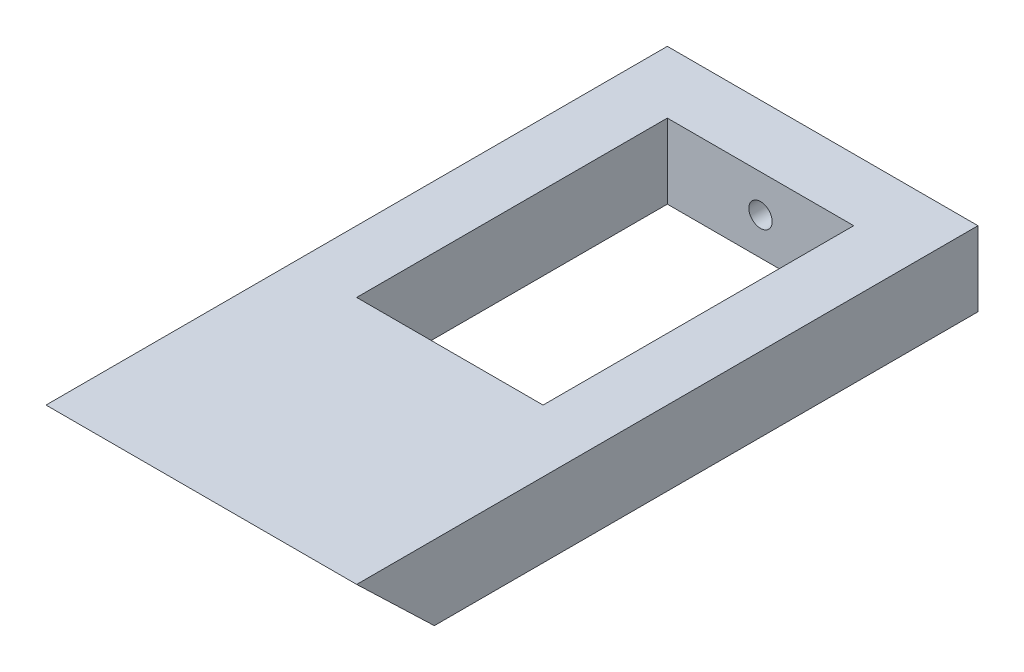
ISO-10303-21;
HEADER;
FILE_DESCRIPTION(('STEP AP214'),'2;1');
FILE_NAME('part.step','',(''),(''),'','','');
FILE_SCHEMA(('AUTOMOTIVE_DESIGN { 1 0 10303 214 1 1 1 1 }'));
ENDSEC;
DATA;
#1=APPLICATION_CONTEXT('core data for automotive mechanical design processes');
#2=APPLICATION_PROTOCOL_DEFINITION('international standard','automotive_design',2000,#1);
#3=PRODUCT_CONTEXT('',#1,'mechanical');
#4=PRODUCT('Part','Part','',(#3));
#5=PRODUCT_RELATED_PRODUCT_CATEGORY('part','',(#4));
#6=PRODUCT_DEFINITION_FORMATION('','',#4);
#7=PRODUCT_DEFINITION_CONTEXT('part definition',#1,'design');
#8=PRODUCT_DEFINITION('design','',#6,#7);
#9=PRODUCT_DEFINITION_SHAPE('','',#8);
#10=(LENGTH_UNIT() NAMED_UNIT(*) SI_UNIT(.MILLI.,.METRE.));
#11=(NAMED_UNIT(*) PLANE_ANGLE_UNIT() SI_UNIT($,.RADIAN.));
#12=(NAMED_UNIT(*) SI_UNIT($,.STERADIAN.) SOLID_ANGLE_UNIT());
#13=UNCERTAINTY_MEASURE_WITH_UNIT(LENGTH_MEASURE(1.E-05),#10,'distance_accuracy_value','');
#14=(GEOMETRIC_REPRESENTATION_CONTEXT(3) GLOBAL_UNCERTAINTY_ASSIGNED_CONTEXT((#13)) GLOBAL_UNIT_ASSIGNED_CONTEXT((#10,
#11,#12)) REPRESENTATION_CONTEXT('',''));
#15=CARTESIAN_POINT('',(0.,0.,0.));
#16=DIRECTION('',(0.,0.,1.));
#17=DIRECTION('',(1.,0.,0.));
#18=AXIS2_PLACEMENT_3D('',#15,#16,#17);
#19=CARTESIAN_POINT('',(12.7,6.096,25.4));
#20=DIRECTION('',(-1.,0.,0.));
#21=DIRECTION('',(0.,0.,1.));
#22=AXIS2_PLACEMENT_3D('',#19,#20,#21);
#23=PLANE('',#22);
#24=DIRECTION('',(0.,0.,-1.));
#25=VECTOR('',#24,1.);
#26=CARTESIAN_POINT('',(12.7,6.096,25.4));
#27=LINE('',#26,#25);
#28=CARTESIAN_POINT('',(12.7,6.096,25.4));
#29=VERTEX_POINT('',#28);
#30=CARTESIAN_POINT('',(12.7,6.096,-25.4));
#31=VERTEX_POINT('',#30);
#32=EDGE_CURVE('E151',#29,#31,#27,.T.);
#33=ORIENTED_EDGE('',*,*,#32,.F.);
#34=DIRECTION('',(0.,0.692531828189714,0.721387321030951));
#35=VECTOR('',#34,1.);
#36=CARTESIAN_POINT('',(12.7,0.,19.05));
#37=LINE('',#36,#35);
#38=CARTESIAN_POINT('',(12.7,0.,19.05));
#39=VERTEX_POINT('',#38);
#40=EDGE_CURVE('E140',#39,#29,#37,.T.);
#41=ORIENTED_EDGE('',*,*,#40,.F.);
#42=DIRECTION('',(0.,0.,-1.));
#43=VECTOR('',#42,1.);
#44=CARTESIAN_POINT('',(12.7,0.,25.4));
#45=LINE('',#44,#43);
#46=CARTESIAN_POINT('',(12.7,0.,-25.4));
#47=VERTEX_POINT('',#46);
#48=EDGE_CURVE('E150',#39,#47,#45,.T.);
#49=ORIENTED_EDGE('',*,*,#48,.T.);
#50=DIRECTION('',(0.,-1.,0.));
#51=VECTOR('',#50,1.);
#52=CARTESIAN_POINT('',(12.7,6.096,-25.4));
#53=LINE('',#52,#51);
#54=EDGE_CURVE('E11',#31,#47,#53,.T.);
#55=ORIENTED_EDGE('',*,*,#54,.F.);
#56=EDGE_LOOP('',(#33,#41,#49,#55));
#57=FACE_BOUND('',#56,.T.);
#58=ADVANCED_FACE('F39',(#57),#23,.F.);
#59=CARTESIAN_POINT('',(-12.7,6.096,-25.4));
#60=DIRECTION('',(0.,0.,1.));
#61=DIRECTION('',(1.,0.,0.));
#62=AXIS2_PLACEMENT_3D('',#59,#60,#61);
#63=PLANE('',#62);
#64=CARTESIAN_POINT('',(0.,3.048,-25.4));
#65=DIRECTION('',(0.,0.,-1.));
#66=DIRECTION('',(-1.,0.,0.));
#67=AXIS2_PLACEMENT_3D('',#64,#65,#66);
#68=CIRCLE('',#67,0.9525);
#69=CARTESIAN_POINT('',(-0.9525,3.048,-25.4));
#70=VERTEX_POINT('',#69);
#71=EDGE_CURVE('E237',#70,#70,#68,.T.);
#72=ORIENTED_EDGE('',*,*,#71,.F.);
#73=EDGE_LOOP('',(#72));
#74=FACE_BOUND('',#73,.T.);
#75=DIRECTION('',(-1.,0.,0.));
#76=VECTOR('',#75,1.);
#77=CARTESIAN_POINT('',(-12.7,0.,-25.4));
#78=LINE('',#77,#76);
#79=CARTESIAN_POINT('',(-12.7,0.,-25.4));
#80=VERTEX_POINT('',#79);
#81=EDGE_CURVE('E164',#47,#80,#78,.T.);
#82=ORIENTED_EDGE('',*,*,#81,.T.);
#83=DIRECTION('',(0.,-1.,0.));
#84=VECTOR('',#83,1.);
#85=CARTESIAN_POINT('',(-12.7,6.096,-25.4));
#86=LINE('',#85,#84);
#87=CARTESIAN_POINT('',(-12.7,6.096,-25.4));
#88=VERTEX_POINT('',#87);
#89=EDGE_CURVE('E46',#88,#80,#86,.T.);
#90=ORIENTED_EDGE('',*,*,#89,.F.);
#91=DIRECTION('',(-1.,0.,0.));
#92=VECTOR('',#91,1.);
#93=CARTESIAN_POINT('',(-12.7,6.096,-25.4));
#94=LINE('',#93,#92);
#95=EDGE_CURVE('E154',#31,#88,#94,.T.);
#96=ORIENTED_EDGE('',*,*,#95,.F.);
#97=ORIENTED_EDGE('',*,*,#54,.T.);
#98=EDGE_LOOP('',(#82,#90,#96,#97));
#99=FACE_BOUND('',#98,.T.);
#100=ADVANCED_FACE('F185',(#74,#99),#63,.F.);
#101=CARTESIAN_POINT('',(-12.7,6.096,25.4));
#102=DIRECTION('',(1.,0.,0.));
#103=DIRECTION('',(0.,0.,-1.));
#104=AXIS2_PLACEMENT_3D('',#101,#102,#103);
#105=PLANE('',#104);
#106=DIRECTION('',(0.,0.,1.));
#107=VECTOR('',#106,1.);
#108=CARTESIAN_POINT('',(-12.7,0.,25.4));
#109=LINE('',#108,#107);
#110=CARTESIAN_POINT('',(-12.7,0.,19.05));
#111=VERTEX_POINT('',#110);
#112=EDGE_CURVE('E155',#80,#111,#109,.T.);
#113=ORIENTED_EDGE('',*,*,#112,.T.);
#114=DIRECTION('',(0.,0.692531828189714,0.721387321030951));
#115=VECTOR('',#114,1.);
#116=CARTESIAN_POINT('',(-12.7,0.,19.05));
#117=LINE('',#116,#115);
#118=CARTESIAN_POINT('',(-12.7,6.096,25.4));
#119=VERTEX_POINT('',#118);
#120=EDGE_CURVE('E144',#111,#119,#117,.T.);
#121=ORIENTED_EDGE('',*,*,#120,.T.);
#122=DIRECTION('',(0.,0.,1.));
#123=VECTOR('',#122,1.);
#124=CARTESIAN_POINT('',(-12.7,6.096,25.4));
#125=LINE('',#124,#123);
#126=EDGE_CURVE('E157',#88,#119,#125,.T.);
#127=ORIENTED_EDGE('',*,*,#126,.F.);
#128=ORIENTED_EDGE('',*,*,#89,.T.);
#129=EDGE_LOOP('',(#113,#121,#127,#128));
#130=FACE_BOUND('',#129,.T.);
#131=ADVANCED_FACE('F172',(#130),#105,.F.);
#132=CARTESIAN_POINT('',(0.,6.096,0.));
#133=DIRECTION('',(0.,-1.,0.));
#134=DIRECTION('',(0.,0.,-1.));
#135=AXIS2_PLACEMENT_3D('',#132,#133,#134);
#136=PLANE('',#135);
#137=DIRECTION('',(-1.,0.,0.));
#138=VECTOR('',#137,1.);
#139=CARTESIAN_POINT('',(-7.62,6.096,5.08));
#140=LINE('',#139,#138);
#141=CARTESIAN_POINT('',(7.62,6.096,5.08));
#142=VERTEX_POINT('',#141);
#143=CARTESIAN_POINT('',(-7.62,6.096,5.08));
#144=VERTEX_POINT('',#143);
#145=EDGE_CURVE('E111',#142,#144,#140,.T.);
#146=ORIENTED_EDGE('',*,*,#145,.T.);
#147=DIRECTION('',(0.,0.,-1.));
#148=VECTOR('',#147,1.);
#149=CARTESIAN_POINT('',(-7.62,6.096,-20.32));
#150=LINE('',#149,#148);
#151=CARTESIAN_POINT('',(-7.62,6.096,-20.32));
#152=VERTEX_POINT('',#151);
#153=EDGE_CURVE('E105',#144,#152,#150,.T.);
#154=ORIENTED_EDGE('',*,*,#153,.T.);
#155=DIRECTION('',(1.,0.,0.));
#156=VECTOR('',#155,1.);
#157=CARTESIAN_POINT('',(-7.62,6.096,-20.32));
#158=LINE('',#157,#156);
#159=CARTESIAN_POINT('',(7.62,6.096,-20.32));
#160=VERTEX_POINT('',#159);
#161=EDGE_CURVE('E114',#152,#160,#158,.T.);
#162=ORIENTED_EDGE('',*,*,#161,.T.);
#163=DIRECTION('',(0.,0.,1.));
#164=VECTOR('',#163,1.);
#165=CARTESIAN_POINT('',(7.62,6.096,-20.32));
#166=LINE('',#165,#164);
#167=EDGE_CURVE('E53',#160,#142,#166,.T.);
#168=ORIENTED_EDGE('',*,*,#167,.T.);
#169=EDGE_LOOP('',(#146,#154,#162,#168));
#170=FACE_BOUND('',#169,.T.);
#171=ORIENTED_EDGE('',*,*,#32,.T.);
#172=ORIENTED_EDGE('',*,*,#95,.T.);
#173=ORIENTED_EDGE('',*,*,#126,.T.);
#174=DIRECTION('',(1.,0.,0.));
#175=VECTOR('',#174,1.);
#176=CARTESIAN_POINT('',(-12.7,6.096,25.4));
#177=LINE('',#176,#175);
#178=EDGE_CURVE('E160',#119,#29,#177,.T.);
#179=ORIENTED_EDGE('',*,*,#178,.T.);
#180=EDGE_LOOP('',(#171,#172,#173,#179));
#181=FACE_BOUND('',#180,.T.);
#182=ADVANCED_FACE('F118',(#170,#181),#136,.F.);
#183=CARTESIAN_POINT('',(0.,0.,0.));
#184=DIRECTION('',(0.,-1.,0.));
#185=DIRECTION('',(0.,0.,-1.));
#186=AXIS2_PLACEMENT_3D('',#183,#184,#185);
#187=PLANE('',#186);
#188=DIRECTION('',(0.,0.,-1.));
#189=VECTOR('',#188,1.);
#190=CARTESIAN_POINT('',(-7.62,0.,-20.32));
#191=LINE('',#190,#189);
#192=CARTESIAN_POINT('',(-7.62,0.,5.08));
#193=VERTEX_POINT('',#192);
#194=CARTESIAN_POINT('',(-7.62,0.,-20.32));
#195=VERTEX_POINT('',#194);
#196=EDGE_CURVE('E61',#193,#195,#191,.T.);
#197=ORIENTED_EDGE('',*,*,#196,.F.);
#198=DIRECTION('',(-1.,0.,0.));
#199=VECTOR('',#198,1.);
#200=CARTESIAN_POINT('',(-7.62,0.,5.08));
#201=LINE('',#200,#199);
#202=CARTESIAN_POINT('',(7.62,0.,5.08));
#203=VERTEX_POINT('',#202);
#204=EDGE_CURVE('E121',#203,#193,#201,.T.);
#205=ORIENTED_EDGE('',*,*,#204,.F.);
#206=DIRECTION('',(0.,0.,1.));
#207=VECTOR('',#206,1.);
#208=CARTESIAN_POINT('',(7.62,0.,-20.32));
#209=LINE('',#208,#207);
#210=CARTESIAN_POINT('',(7.62,0.,-20.32));
#211=VERTEX_POINT('',#210);
#212=EDGE_CURVE('E124',#211,#203,#209,.T.);
#213=ORIENTED_EDGE('',*,*,#212,.F.);
#214=DIRECTION('',(1.,0.,0.));
#215=VECTOR('',#214,1.);
#216=CARTESIAN_POINT('',(-7.62,0.,-20.32));
#217=LINE('',#216,#215);
#218=EDGE_CURVE('E133',#195,#211,#217,.T.);
#219=ORIENTED_EDGE('',*,*,#218,.F.);
#220=EDGE_LOOP('',(#197,#205,#213,#219));
#221=FACE_BOUND('',#220,.T.);
#222=DIRECTION('',(1.,0.,0.));
#223=VECTOR('',#222,1.);
#224=CARTESIAN_POINT('',(-12.7,0.,19.05));
#225=LINE('',#224,#223);
#226=EDGE_CURVE('E147',#111,#39,#225,.T.);
#227=ORIENTED_EDGE('',*,*,#226,.F.);
#228=ORIENTED_EDGE('',*,*,#112,.F.);
#229=ORIENTED_EDGE('',*,*,#81,.F.);
#230=ORIENTED_EDGE('',*,*,#48,.F.);
#231=EDGE_LOOP('',(#227,#228,#229,#230));
#232=FACE_BOUND('',#231,.T.);
#233=ADVANCED_FACE('F177',(#221,#232),#187,.T.);
#234=CARTESIAN_POINT('',(-12.7,0.,19.05));
#235=DIRECTION('',(0.,0.721387321030951,-0.692531828189714));
#236=DIRECTION('',(0.,0.692531828189714,0.721387321030951));
#237=AXIS2_PLACEMENT_3D('',#234,#235,#236);
#238=PLANE('',#237);
#239=ORIENTED_EDGE('',*,*,#40,.T.);
#240=ORIENTED_EDGE('',*,*,#178,.F.);
#241=ORIENTED_EDGE('',*,*,#120,.F.);
#242=ORIENTED_EDGE('',*,*,#226,.T.);
#243=EDGE_LOOP('',(#239,#240,#241,#242));
#244=FACE_BOUND('',#243,.T.);
#245=ADVANCED_FACE('F181',(#244),#238,.F.);
#246=CARTESIAN_POINT('',(-7.62,6.096,-20.32));
#247=DIRECTION('',(-1.,0.,0.));
#248=DIRECTION('',(0.,0.,1.));
#249=AXIS2_PLACEMENT_3D('',#246,#247,#248);
#250=PLANE('',#249);
#251=ORIENTED_EDGE('',*,*,#196,.T.);
#252=DIRECTION('',(0.,-1.,0.));
#253=VECTOR('',#252,1.);
#254=CARTESIAN_POINT('',(-7.62,6.096,-20.32));
#255=LINE('',#254,#253);
#256=EDGE_CURVE('E101',#152,#195,#255,.T.);
#257=ORIENTED_EDGE('',*,*,#256,.F.);
#258=ORIENTED_EDGE('',*,*,#153,.F.);
#259=DIRECTION('',(0.,-1.,0.));
#260=VECTOR('',#259,1.);
#261=CARTESIAN_POINT('',(-7.62,6.096,5.08));
#262=LINE('',#261,#260);
#263=EDGE_CURVE('E138',#144,#193,#262,.T.);
#264=ORIENTED_EDGE('',*,*,#263,.T.);
#265=EDGE_LOOP('',(#251,#257,#258,#264));
#266=FACE_BOUND('',#265,.T.);
#267=ADVANCED_FACE('F103',(#266),#250,.F.);
#268=CARTESIAN_POINT('',(-7.62,6.096,5.08));
#269=DIRECTION('',(0.,0.,1.));
#270=DIRECTION('',(1.,0.,0.));
#271=AXIS2_PLACEMENT_3D('',#268,#269,#270);
#272=PLANE('',#271);
#273=CARTESIAN_POINT('',(3.81,3.302,5.08));
#274=DIRECTION('',(0.,0.,-1.));
#275=DIRECTION('',(-1.,0.,0.));
#276=AXIS2_PLACEMENT_3D('',#273,#274,#275);
#277=CIRCLE('',#276,2.286);
#278=CARTESIAN_POINT('',(1.524,3.302,5.08));
#279=VERTEX_POINT('',#278);
#280=EDGE_CURVE('E246',#279,#279,#277,.T.);
#281=ORIENTED_EDGE('',*,*,#280,.F.);
#282=EDGE_LOOP('',(#281));
#283=FACE_BOUND('',#282,.T.);
#284=CARTESIAN_POINT('',(-3.81,3.302,5.08));
#285=DIRECTION('',(0.,0.,-1.));
#286=DIRECTION('',(-1.,0.,0.));
#287=AXIS2_PLACEMENT_3D('',#284,#285,#286);
#288=CIRCLE('',#287,2.286);
#289=CARTESIAN_POINT('',(-6.096,3.302,5.08));
#290=VERTEX_POINT('',#289);
#291=EDGE_CURVE('E248',#290,#290,#288,.T.);
#292=ORIENTED_EDGE('',*,*,#291,.F.);
#293=EDGE_LOOP('',(#292));
#294=FACE_BOUND('',#293,.T.);
#295=ORIENTED_EDGE('',*,*,#204,.T.);
#296=ORIENTED_EDGE('',*,*,#263,.F.);
#297=ORIENTED_EDGE('',*,*,#145,.F.);
#298=DIRECTION('',(0.,-1.,0.));
#299=VECTOR('',#298,1.);
#300=CARTESIAN_POINT('',(7.62,6.096,5.08));
#301=LINE('',#300,#299);
#302=EDGE_CURVE('E141',#142,#203,#301,.T.);
#303=ORIENTED_EDGE('',*,*,#302,.T.);
#304=EDGE_LOOP('',(#295,#296,#297,#303));
#305=FACE_BOUND('',#304,.T.);
#306=ADVANCED_FACE('F206',(#283,#294,#305),#272,.F.);
#307=CARTESIAN_POINT('',(7.62,6.096,-20.32));
#308=DIRECTION('',(1.,0.,0.));
#309=DIRECTION('',(0.,0.,-1.));
#310=AXIS2_PLACEMENT_3D('',#307,#308,#309);
#311=PLANE('',#310);
#312=ORIENTED_EDGE('',*,*,#212,.T.);
#313=ORIENTED_EDGE('',*,*,#302,.F.);
#314=ORIENTED_EDGE('',*,*,#167,.F.);
#315=DIRECTION('',(0.,-1.,0.));
#316=VECTOR('',#315,1.);
#317=CARTESIAN_POINT('',(7.62,6.096,-20.32));
#318=LINE('',#317,#316);
#319=EDGE_CURVE('E110',#160,#211,#318,.T.);
#320=ORIENTED_EDGE('',*,*,#319,.T.);
#321=EDGE_LOOP('',(#312,#313,#314,#320));
#322=FACE_BOUND('',#321,.T.);
#323=ADVANCED_FACE('F209',(#322),#311,.F.);
#324=CARTESIAN_POINT('',(-7.62,6.096,-20.32));
#325=DIRECTION('',(0.,0.,-1.));
#326=DIRECTION('',(-1.,0.,0.));
#327=AXIS2_PLACEMENT_3D('',#324,#325,#326);
#328=PLANE('',#327);
#329=CARTESIAN_POINT('',(0.,3.048,-20.32));
#330=DIRECTION('',(0.,0.,-1.));
#331=DIRECTION('',(-1.,0.,0.));
#332=AXIS2_PLACEMENT_3D('',#329,#330,#331);
#333=CIRCLE('',#332,0.9525);
#334=CARTESIAN_POINT('',(-0.9525,3.048,-20.32));
#335=VERTEX_POINT('',#334);
#336=EDGE_CURVE('E240',#335,#335,#333,.F.);
#337=ORIENTED_EDGE('',*,*,#336,.F.);
#338=EDGE_LOOP('',(#337));
#339=FACE_BOUND('',#338,.T.);
#340=ORIENTED_EDGE('',*,*,#218,.T.);
#341=ORIENTED_EDGE('',*,*,#319,.F.);
#342=ORIENTED_EDGE('',*,*,#161,.F.);
#343=ORIENTED_EDGE('',*,*,#256,.T.);
#344=EDGE_LOOP('',(#340,#341,#342,#343));
#345=FACE_BOUND('',#344,.T.);
#346=ADVANCED_FACE('F115',(#339,#345),#328,.F.);
#347=CARTESIAN_POINT('',(-3.81,3.302,7.62));
#348=DIRECTION('',(0.,0.,-1.));
#349=DIRECTION('',(-1.,0.,0.));
#350=AXIS2_PLACEMENT_3D('',#347,#348,#349);
#351=CYLINDRICAL_SURFACE('',#350,2.286);
#352=CARTESIAN_POINT('',(-3.81,3.302,7.62));
#353=DIRECTION('',(0.,0.,-1.));
#354=DIRECTION('',(-1.,0.,0.));
#355=AXIS2_PLACEMENT_3D('',#352,#353,#354);
#356=CIRCLE('',#355,2.286);
#357=CARTESIAN_POINT('',(-6.096,3.302,7.62));
#358=VERTEX_POINT('',#357);
#359=EDGE_CURVE('E127',#358,#358,#356,.T.);
#360=ORIENTED_EDGE('',*,*,#359,.F.);
#361=EDGE_LOOP('',(#360));
#362=FACE_BOUND('',#361,.T.);
#363=ORIENTED_EDGE('',*,*,#291,.T.);
#364=EDGE_LOOP('',(#363));
#365=FACE_BOUND('',#364,.T.);
#366=ADVANCED_FACE('F208',(#362,#365),#351,.F.);
#367=CARTESIAN_POINT('',(-3.81,3.302,7.62));
#368=DIRECTION('',(0.,0.,-1.));
#369=DIRECTION('',(-1.,0.,0.));
#370=AXIS2_PLACEMENT_3D('',#367,#368,#369);
#371=PLANE('',#370);
#372=ORIENTED_EDGE('',*,*,#359,.T.);
#373=EDGE_LOOP('',(#372));
#374=FACE_BOUND('',#373,.T.);
#375=ADVANCED_FACE('F216',(#374),#371,.T.);
#376=CARTESIAN_POINT('',(3.81,3.302,7.62));
#377=DIRECTION('',(0.,0.,-1.));
#378=DIRECTION('',(-1.,0.,0.));
#379=AXIS2_PLACEMENT_3D('',#376,#377,#378);
#380=CYLINDRICAL_SURFACE('',#379,2.286);
#381=CARTESIAN_POINT('',(3.81,3.302,7.62));
#382=DIRECTION('',(0.,0.,-1.));
#383=DIRECTION('',(-1.,0.,0.));
#384=AXIS2_PLACEMENT_3D('',#381,#382,#383);
#385=CIRCLE('',#384,2.286);
#386=CARTESIAN_POINT('',(1.524,3.302,7.62));
#387=VERTEX_POINT('',#386);
#388=EDGE_CURVE('E134',#387,#387,#385,.T.);
#389=ORIENTED_EDGE('',*,*,#388,.F.);
#390=EDGE_LOOP('',(#389));
#391=FACE_BOUND('',#390,.T.);
#392=ORIENTED_EDGE('',*,*,#280,.T.);
#393=EDGE_LOOP('',(#392));
#394=FACE_BOUND('',#393,.T.);
#395=ADVANCED_FACE('F219',(#391,#394),#380,.F.);
#396=CARTESIAN_POINT('',(3.81,3.302,7.62));
#397=DIRECTION('',(0.,0.,-1.));
#398=DIRECTION('',(-1.,0.,0.));
#399=AXIS2_PLACEMENT_3D('',#396,#397,#398);
#400=PLANE('',#399);
#401=ORIENTED_EDGE('',*,*,#388,.T.);
#402=EDGE_LOOP('',(#401));
#403=FACE_BOUND('',#402,.T.);
#404=ADVANCED_FACE('F226',(#403),#400,.T.);
#405=CARTESIAN_POINT('',(0.,3.048,25.401));
#406=DIRECTION('',(0.,0.,-1.));
#407=DIRECTION('',(-1.,0.,0.));
#408=AXIS2_PLACEMENT_3D('',#405,#406,#407);
#409=CYLINDRICAL_SURFACE('',#408,0.9525);
#410=ORIENTED_EDGE('',*,*,#71,.T.);
#411=EDGE_LOOP('',(#410));
#412=FACE_BOUND('',#411,.T.);
#413=ORIENTED_EDGE('',*,*,#336,.T.);
#414=EDGE_LOOP('',(#413));
#415=FACE_BOUND('',#414,.T.);
#416=ADVANCED_FACE('F229',(#412,#415),#409,.F.);
#417=CLOSED_SHELL('',(#58,#100,#131,#182,#233,#245,#267,#306,#323,#346,#366,#375,#395,#404,#416));
#418=MANIFOLD_SOLID_BREP('B2',#417);
#419=ADVANCED_BREP_SHAPE_REPRESENTATION('',(#18,#418),#14);
#420=SHAPE_DEFINITION_REPRESENTATION(#9,#419);
ENDSEC;
END-ISO-10303-21;
